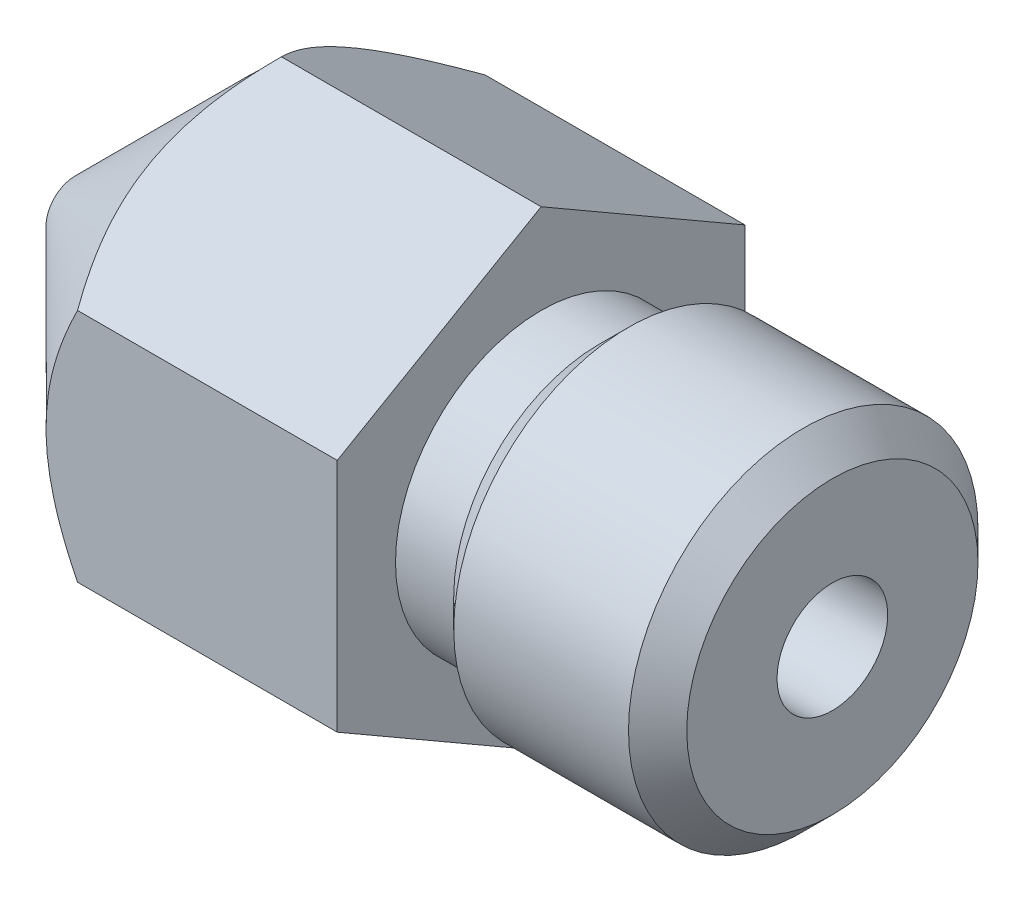
ISO-10303-21;
HEADER;
FILE_DESCRIPTION(('STEP AP214'),'2;1');
FILE_NAME('part.step','',(''),(''),'','','');
FILE_SCHEMA(('AUTOMOTIVE_DESIGN { 1 0 10303 214 1 1 1 1 }'));
ENDSEC;
DATA;
#1=APPLICATION_CONTEXT('core data for automotive mechanical design processes');
#2=APPLICATION_PROTOCOL_DEFINITION('international standard','automotive_design',2000,#1);
#3=PRODUCT_CONTEXT('',#1,'mechanical');
#4=PRODUCT('Part','Part','',(#3));
#5=PRODUCT_RELATED_PRODUCT_CATEGORY('part','',(#4));
#6=PRODUCT_DEFINITION_FORMATION('','',#4);
#7=PRODUCT_DEFINITION_CONTEXT('part definition',#1,'design');
#8=PRODUCT_DEFINITION('design','',#6,#7);
#9=PRODUCT_DEFINITION_SHAPE('','',#8);
#10=(LENGTH_UNIT() NAMED_UNIT(*) SI_UNIT(.MILLI.,.METRE.));
#11=(NAMED_UNIT(*) PLANE_ANGLE_UNIT() SI_UNIT($,.RADIAN.));
#12=(NAMED_UNIT(*) SI_UNIT($,.STERADIAN.) SOLID_ANGLE_UNIT());
#13=UNCERTAINTY_MEASURE_WITH_UNIT(LENGTH_MEASURE(1.E-05),#10,'distance_accuracy_value','');
#14=(GEOMETRIC_REPRESENTATION_CONTEXT(3) GLOBAL_UNCERTAINTY_ASSIGNED_CONTEXT((#13)) GLOBAL_UNIT_ASSIGNED_CONTEXT((#10,
#11,#12)) REPRESENTATION_CONTEXT('',''));
#15=CARTESIAN_POINT('',(0.,0.,0.));
#16=DIRECTION('',(0.,0.,1.));
#17=DIRECTION('',(1.,0.,0.));
#18=AXIS2_PLACEMENT_3D('',#15,#16,#17);
#19=CARTESIAN_POINT('',(8.,2.5,0.));
#20=DIRECTION('',(-1.,0.,0.));
#21=DIRECTION('',(0.,0.,1.));
#22=AXIS2_PLACEMENT_3D('',#19,#20,#21);
#23=PLANE('',#22);
#24=CARTESIAN_POINT('',(8.,0.,0.));
#25=DIRECTION('',(-1.,0.,0.));
#26=DIRECTION('',(0.,0.,1.));
#27=AXIS2_PLACEMENT_3D('',#24,#25,#26);
#28=CIRCLE('',#27,2.5);
#29=CARTESIAN_POINT('',(8.,0.,2.5));
#30=VERTEX_POINT('',#29);
#31=EDGE_CURVE('E133',#30,#30,#28,.T.);
#32=ORIENTED_EDGE('',*,*,#31,.T.);
#33=EDGE_LOOP('',(#32));
#34=FACE_BOUND('',#33,.T.);
#35=DIRECTION('',(0.,-1.,0.));
#36=VECTOR('',#35,1.);
#37=CARTESIAN_POINT('',(8.,2.02072594216369,3.5));
#38=LINE('',#37,#36);
#39=CARTESIAN_POINT('',(8.,2.02072594216369,3.5));
#40=VERTEX_POINT('',#39);
#41=CARTESIAN_POINT('',(8.,-2.02072594216369,3.5));
#42=VERTEX_POINT('',#41);
#43=EDGE_CURVE('E112',#40,#42,#38,.T.);
#44=ORIENTED_EDGE('',*,*,#43,.T.);
#45=DIRECTION('',(0.,-0.5,-0.866025403784439));
#46=VECTOR('',#45,1.);
#47=CARTESIAN_POINT('',(8.,-2.02072594216369,3.5));
#48=LINE('',#47,#46);
#49=CARTESIAN_POINT('',(8.,-4.04145188432738,0.));
#50=VERTEX_POINT('',#49);
#51=EDGE_CURVE('E110',#42,#50,#48,.T.);
#52=ORIENTED_EDGE('',*,*,#51,.T.);
#53=DIRECTION('',(0.,0.5,-0.866025403784439));
#54=VECTOR('',#53,1.);
#55=CARTESIAN_POINT('',(8.,-4.04145188432738,0.));
#56=LINE('',#55,#54);
#57=CARTESIAN_POINT('',(8.,-2.02072594216369,-3.5));
#58=VERTEX_POINT('',#57);
#59=EDGE_CURVE('E52',#50,#58,#56,.T.);
#60=ORIENTED_EDGE('',*,*,#59,.T.);
#61=DIRECTION('',(0.,1.,0.));
#62=VECTOR('',#61,1.);
#63=CARTESIAN_POINT('',(8.,-2.02072594216369,-3.5));
#64=LINE('',#63,#62);
#65=CARTESIAN_POINT('',(8.,2.02072594216369,-3.5));
#66=VERTEX_POINT('',#65);
#67=EDGE_CURVE('E100',#58,#66,#64,.T.);
#68=ORIENTED_EDGE('',*,*,#67,.T.);
#69=DIRECTION('',(0.,0.5,0.866025403784439));
#70=VECTOR('',#69,1.);
#71=CARTESIAN_POINT('',(8.,2.02072594216369,-3.5));
#72=LINE('',#71,#70);
#73=CARTESIAN_POINT('',(8.,4.04145188432738,0.));
#74=VERTEX_POINT('',#73);
#75=EDGE_CURVE('E106',#66,#74,#72,.T.);
#76=ORIENTED_EDGE('',*,*,#75,.T.);
#77=DIRECTION('',(0.,-0.5,0.866025403784439));
#78=VECTOR('',#77,1.);
#79=CARTESIAN_POINT('',(8.,4.04145188432738,0.));
#80=LINE('',#79,#78);
#81=EDGE_CURVE('E117',#74,#40,#80,.T.);
#82=ORIENTED_EDGE('',*,*,#81,.T.);
#83=EDGE_LOOP('',(#44,#52,#60,#68,#76,#82));
#84=FACE_BOUND('',#83,.T.);
#85=ADVANCED_FACE('F37',(#34,#84),#23,.F.);
#86=CARTESIAN_POINT('',(4.,0.,0.));
#87=DIRECTION('',(1.,0.,0.));
#88=DIRECTION('',(0.,0.,-1.));
#89=AXIS2_PLACEMENT_3D('',#86,#87,#88);
#90=CONICAL_SURFACE('',#89,4.5,0.78539816339745);
#91=CARTESIAN_POINT('',(0.,0.,0.));
#92=DIRECTION('',(-1.,0.,0.));
#93=DIRECTION('',(0.,0.,1.));
#94=AXIS2_PLACEMENT_3D('',#91,#92,#93);
#95=CIRCLE('',#94,0.499999999999984);
#96=CARTESIAN_POINT('',(0.,0.,0.499999999999984));
#97=VERTEX_POINT('',#96);
#98=EDGE_CURVE('E130',#97,#97,#95,.T.);
#99=ORIENTED_EDGE('',*,*,#98,.F.);
#100=EDGE_LOOP('',(#99));
#101=FACE_BOUND('',#100,.T.);
#102=CARTESIAN_POINT('',(5.60473460571073,-5.00177814443646,3.5));
#103=CARTESIAN_POINT('',(5.50158525305018,-4.87585100221837,3.5));
#104=CARTESIAN_POINT('',(5.39916732462682,-4.74931512243237,3.5));
#105=CARTESIAN_POINT('',(5.19618183428807,-4.49471658352455,3.5));
#106=CARTESIAN_POINT('',(5.09561475080956,-4.36665354335295,3.5));
#107=CARTESIAN_POINT('',(4.8956806099685,-4.1073404488107,3.5));
#108=CARTESIAN_POINT('',(4.79633882689846,-3.97607084326665,3.5));
#109=CARTESIAN_POINT('',(4.60061166670264,-3.71135912834578,3.5));
#110=CARTESIAN_POINT('',(4.50422600560764,-3.57791722953954,3.5));
#111=CARTESIAN_POINT('',(4.30644876507746,-3.29590423287125,3.5));
#112=CARTESIAN_POINT('',(4.20542063931455,-3.14707678989524,3.5));
#113=CARTESIAN_POINT('',(4.0092782092562,-2.84547482694549,3.5));
#114=CARTESIAN_POINT('',(3.91416582545941,-2.69269904772549,3.5));
#115=CARTESIAN_POINT('',(3.73242858701602,-2.38308612845867,3.5));
#116=CARTESIAN_POINT('',(3.64576650922454,-2.22627104221582,3.5));
#117=CARTESIAN_POINT('',(3.48347840457084,-1.90708387824138,3.5));
#118=CARTESIAN_POINT('',(3.4078428797255,-1.74471673355065,3.5));
#119=CARTESIAN_POINT('',(3.29115360790501,-1.46096984620552,3.5));
#120=CARTESIAN_POINT('',(3.24639235010286,-1.34112588832474,3.5));
#121=CARTESIAN_POINT('',(3.16645824704642,-1.09820885957048,3.5));
#122=CARTESIAN_POINT('',(3.13128671673046,-0.975135348396179,3.5));
#123=CARTESIAN_POINT('',(3.07315329237583,-0.728966718302567,3.5));
#124=CARTESIAN_POINT('',(3.04993834404319,-0.605932392197103,3.5));
#125=CARTESIAN_POINT('',(3.01613662323999,-0.358129563749721,3.5));
#126=CARTESIAN_POINT('',(3.00554687121748,-0.233361477610497,3.5));
#127=CARTESIAN_POINT('',(2.9980076393283,0.0101654253989616,3.5));
#128=CARTESIAN_POINT('',(3.0003849263801,0.128903431666411,3.5));
#129=CARTESIAN_POINT('',(3.01705527222058,0.365532552222858,3.5));
#130=CARTESIAN_POINT('',(3.03134918273084,0.483423605369748,3.5));
#131=CARTESIAN_POINT('',(3.07126805871322,0.719563148573866,3.5));
#132=CARTESIAN_POINT('',(3.09710502038985,0.83777515440585,3.5));
#133=CARTESIAN_POINT('',(3.15862164673052,1.07156228973921,3.5));
#134=CARTESIAN_POINT('',(3.19430109896366,1.1871374760929,3.5));
#135=CARTESIAN_POINT('',(3.27495249430218,1.41857905527411,3.5));
#136=CARTESIAN_POINT('',(3.32015561728366,1.53436386685402,3.5));
#137=CARTESIAN_POINT('',(3.41756542323519,1.7629573042304,3.5));
#138=CARTESIAN_POINT('',(3.46977427633029,1.87576499481178,3.5));
#139=CARTESIAN_POINT('',(3.57996695790531,2.09894682323399,3.5));
#140=CARTESIAN_POINT('',(3.63796861954407,2.20931208353451,3.5));
#141=CARTESIAN_POINT('',(3.75847190730103,2.42752018879847,3.5));
#142=CARTESIAN_POINT('',(3.82097285702742,2.53536340969175,3.5));
#143=CARTESIAN_POINT('',(3.94642001487544,2.74357548029041,3.5));
#144=CARTESIAN_POINT('',(4.00919138032335,2.8440502327273,3.5));
#145=CARTESIAN_POINT('',(4.13742428325754,3.04327327614903,3.5));
#146=CARTESIAN_POINT('',(4.20288602031573,3.14202143827798,3.5));
#147=CARTESIAN_POINT('',(4.33549374104825,3.33722918559784,3.5));
#148=CARTESIAN_POINT('',(4.40262218906713,3.43370072609763,3.5));
#149=CARTESIAN_POINT('',(4.53869269345195,3.62531773450166,3.5));
#150=CARTESIAN_POINT('',(4.60763424496689,3.72046356049015,3.5));
#151=CARTESIAN_POINT('',(4.67731849112517,3.81505265475415,3.5));
#152=B_SPLINE_CURVE_WITH_KNOTS('',3,(#102,#103,#104,#105,#106,#107,#108,#109,#110,#111,#112,
#113,#114,#115,#116,#117,#118,#119,#120,#121,#122,#123,#124,#125,#126,#127,#128,#129,#130,#131,
#132,#133,#134,#135,#136,#137,#138,#139,#140,#141,#142,#143,#144,#145,#146,#147,#148,#149,#150,
#151),.UNSPECIFIED.,.F.,.F.,(4,2,2,2,2,2,2,2,2,2,2,2,2,2,2,2,2,2,2,2,2,2,2,2,4),(0.,
0.488349249027166,0.976823010095185,1.47065642848088,1.96444225899961,2.50397255703355,
3.04367710477862,3.58088531780657,4.11762802448125,4.50109851017833,4.88462155073114,
5.25965435197999,5.63459862778907,5.99026775687149,6.34596230901475,6.70847660551895,
7.07098307847279,7.44358822460948,7.81630905811278,8.19021491747463,8.56406468333309,
8.91942809068196,9.27481790665746,9.62738125871665,9.97984745921805),.UNSPECIFIED.);
#153=CARTESIAN_POINT('',(3.54145188432738,2.02072594216369,3.5));
#154=VERTEX_POINT('',#153);
#155=CARTESIAN_POINT('',(3.54145188432738,-2.02072594216369,3.5));
#156=VERTEX_POINT('',#155);
#157=EDGE_CURVE('E180',#154,#156,#152,.F.);
#158=ORIENTED_EDGE('',*,*,#157,.F.);
#159=CARTESIAN_POINT('',(3.5415673593298,4.04156735438122,-0.000199999999999954));
#160=CARTESIAN_POINT('',(3.47216781805871,3.9721070606697,0.120108757817009));
#161=CARTESIAN_POINT('',(3.40684436318291,3.90148531215405,0.24242921436546));
#162=CARTESIAN_POINT('',(3.28723893601392,3.75747991147153,0.491853884911907));
#163=CARTESIAN_POINT('',(3.23302350720678,3.68408256574985,0.618981816842553));
#164=CARTESIAN_POINT('',(3.14015155956122,3.53608035685404,0.875329162282526));
#165=CARTESIAN_POINT('',(3.1012616245349,3.46151318117029,1.00448329914368));
#166=CARTESIAN_POINT('',(3.04134378872047,3.310737295381,1.26563479388695));
#167=CARTESIAN_POINT('',(3.02027116467501,3.2345331906662,1.39762417499828));
#168=CARTESIAN_POINT('',(3.00125799897574,3.10319782183117,1.62510370665135));
#169=CARTESIAN_POINT('',(2.99844358418733,3.04823615399913,1.72030010780516));
#170=CARTESIAN_POINT('',(3.00318657176733,2.93840222621347,1.91053805112478));
#171=CARTESIAN_POINT('',(3.0107476100844,2.88353000435281,2.00557952731163));
#172=CARTESIAN_POINT('',(3.03580978058179,2.77430542200351,2.1947620533761));
#173=CARTESIAN_POINT('',(3.0533220307075,2.71995371223668,2.2889019761705));
#174=CARTESIAN_POINT('',(3.09733078172171,2.61218376551827,2.47556499941577));
#175=CARTESIAN_POINT('',(3.12382659379173,2.55876545732784,2.56808822325597));
#176=CARTESIAN_POINT('',(3.17833985376172,2.46393368006795,2.73234167964216));
#177=CARTESIAN_POINT('',(3.20492418817716,2.42231028209655,2.80443551971228));
#178=CARTESIAN_POINT('',(3.26237725929072,2.33981072759411,2.9473289397123));
#179=CARTESIAN_POINT('',(3.29324612649086,2.29893459386684,3.01812848014492));
#180=CARTESIAN_POINT('',(3.35857622497152,2.21805834837751,3.15821024645785));
#181=CARTESIAN_POINT('',(3.39302615997836,2.17805593632086,3.22749645656528));
#182=CARTESIAN_POINT('',(3.46506598404272,2.09879193666161,3.36478573118621));
#183=CARTESIAN_POINT('',(3.50265394638793,2.05952991236255,3.43278955208019));
#184=CARTESIAN_POINT('',(3.5415673593298,2.02061047210985,3.5002));
#185=B_SPLINE_CURVE_WITH_KNOTS('',3,(#159,#160,#161,#162,#163,#164,#165,#166,#167,#168,#169,
#170,#171,#172,#173,#174,#175,#176,#177,#178,#179,#180,#181,#182,#183,#184),.UNSPECIFIED.,.F.,
.F.,(4,2,2,2,2,2,2,2,2,2,2,2,4),(0.,0.466195029511835,0.935106055247667,1.3965703522971,
1.85687285909025,2.18628459516077,2.51581179896772,2.845707891424,3.17557869467338,
3.43762138891189,3.69967206642681,3.96091985737577,4.22200840855896),.UNSPECIFIED.);
#186=CARTESIAN_POINT('',(3.54145188432739,4.04145188432738,0.));
#187=VERTEX_POINT('',#186);
#188=EDGE_CURVE('E188',#187,#154,#185,.T.);
#189=ORIENTED_EDGE('',*,*,#188,.F.);
#190=CARTESIAN_POINT('',(3.5415673593298,2.02061047210985,-3.5002));
#191=CARTESIAN_POINT('',(3.47216781805871,2.09007076582137,-3.37989124218299));
#192=CARTESIAN_POINT('',(3.40684436318291,2.16069251433702,-3.25757078563454));
#193=CARTESIAN_POINT('',(3.28723893601392,2.30469791501955,-3.0081461150881));
#194=CARTESIAN_POINT('',(3.23302350720678,2.37809526074122,-2.88101818315745));
#195=CARTESIAN_POINT('',(3.14015155956122,2.52609746963704,-2.62467083771748));
#196=CARTESIAN_POINT('',(3.1012616245349,2.60066464532078,-2.49551670085632));
#197=CARTESIAN_POINT('',(3.04134378872047,2.75144053111008,-2.23436520611305));
#198=CARTESIAN_POINT('',(3.02027116467501,2.82764463582488,-2.10237582500172));
#199=CARTESIAN_POINT('',(3.00125799897574,2.9589800046599,-1.87489629334866));
#200=CARTESIAN_POINT('',(2.99844358418733,3.01394167249194,-1.77969989219485));
#201=CARTESIAN_POINT('',(3.00318657176733,3.12377560027761,-1.58946194887522));
#202=CARTESIAN_POINT('',(3.0107476100844,3.17864782213826,-1.49442047268838));
#203=CARTESIAN_POINT('',(3.03580978058179,3.28787240448756,-1.3052379466239));
#204=CARTESIAN_POINT('',(3.0533220307075,3.34222411425439,-1.2110980238295));
#205=CARTESIAN_POINT('',(3.09733078172171,3.4499940609728,-1.02443500058423));
#206=CARTESIAN_POINT('',(3.12382659379173,3.50341236916323,-0.931911776744036));
#207=CARTESIAN_POINT('',(3.17833985376172,3.59824414642313,-0.767658320357845));
#208=CARTESIAN_POINT('',(3.20492418817716,3.63986754439453,-0.69556448028772));
#209=CARTESIAN_POINT('',(3.26237725929072,3.72236709889696,-0.552671060287704));
#210=CARTESIAN_POINT('',(3.29324612649086,3.76324323262424,-0.481871519855082));
#211=CARTESIAN_POINT('',(3.35857622497152,3.84411947811356,-0.341789753542154));
#212=CARTESIAN_POINT('',(3.39302615997836,3.88412189017022,-0.272503543434724));
#213=CARTESIAN_POINT('',(3.46506598404272,3.96338588982946,-0.135214268813787));
#214=CARTESIAN_POINT('',(3.50265394638793,4.00264791412852,-0.0672104479198107));
#215=CARTESIAN_POINT('',(3.5415673593298,4.04156735438122,0.00020000000000017));
#216=B_SPLINE_CURVE_WITH_KNOTS('',3,(#190,#191,#192,#193,#194,#195,#196,#197,#198,#199,#200,
#201,#202,#203,#204,#205,#206,#207,#208,#209,#210,#211,#212,#213,#214,#215),.UNSPECIFIED.,.F.,
.F.,(4,2,2,2,2,2,2,2,2,2,2,2,4),(0.,0.466195029511835,0.935106055247667,1.3965703522971,
1.85687285909025,2.18628459516076,2.51581179896771,2.845707891424,3.17557869467337,
3.43762138891189,3.69967206642681,3.96091985737577,4.22200840855896),.UNSPECIFIED.);
#217=CARTESIAN_POINT('',(3.54145188432739,2.02072594216369,-3.5));
#218=VERTEX_POINT('',#217);
#219=EDGE_CURVE('E256',#218,#187,#216,.T.);
#220=ORIENTED_EDGE('',*,*,#219,.F.);
#221=CARTESIAN_POINT('',(5.60473460571074,-5.00177814443646,-3.5));
#222=CARTESIAN_POINT('',(5.50158525305018,-4.87585100221837,-3.5));
#223=CARTESIAN_POINT('',(5.39916732462683,-4.74931512243238,-3.5));
#224=CARTESIAN_POINT('',(5.19618183428808,-4.49471658352455,-3.5));
#225=CARTESIAN_POINT('',(5.09561475080957,-4.36665354335295,-3.5));
#226=CARTESIAN_POINT('',(4.8956806099685,-4.1073404488107,-3.5));
#227=CARTESIAN_POINT('',(4.79633882689846,-3.97607084326666,-3.5));
#228=CARTESIAN_POINT('',(4.60061166670265,-3.71135912834578,-3.5));
#229=CARTESIAN_POINT('',(4.50422600560765,-3.57791722953954,-3.5));
#230=CARTESIAN_POINT('',(4.30644876507746,-3.29590423287125,-3.5));
#231=CARTESIAN_POINT('',(4.20542063931455,-3.14707678989524,-3.5));
#232=CARTESIAN_POINT('',(4.00927820925621,-2.84547482694549,-3.5));
#233=CARTESIAN_POINT('',(3.91416582545942,-2.69269904772549,-3.5));
#234=CARTESIAN_POINT('',(3.73242858701603,-2.38308612845867,-3.5));
#235=CARTESIAN_POINT('',(3.64576650922454,-2.22627104221582,-3.5));
#236=CARTESIAN_POINT('',(3.48347840457084,-1.90708387824137,-3.5));
#237=CARTESIAN_POINT('',(3.4078428797255,-1.74471673355065,-3.5));
#238=CARTESIAN_POINT('',(3.29115360790502,-1.46096984620551,-3.5));
#239=CARTESIAN_POINT('',(3.24639235010286,-1.34112588832474,-3.5));
#240=CARTESIAN_POINT('',(3.16645824704642,-1.09820885957048,-3.5));
#241=CARTESIAN_POINT('',(3.13128671673046,-0.975135348396178,-3.5));
#242=CARTESIAN_POINT('',(3.07315329237583,-0.728966718302567,-3.5));
#243=CARTESIAN_POINT('',(3.04993834404319,-0.605932392197102,-3.5));
#244=CARTESIAN_POINT('',(3.01613662324,-0.358129563749721,-3.5));
#245=CARTESIAN_POINT('',(3.00554687121749,-0.233361477610496,-3.5));
#246=CARTESIAN_POINT('',(2.9980076393283,0.0101654253989624,-3.5));
#247=CARTESIAN_POINT('',(3.0003849263801,0.128903431666412,-3.5));
#248=CARTESIAN_POINT('',(3.01705527222059,0.365532552222859,-3.5));
#249=CARTESIAN_POINT('',(3.03134918273085,0.48342360536975,-3.5));
#250=CARTESIAN_POINT('',(3.07126805871322,0.719563148573868,-3.5));
#251=CARTESIAN_POINT('',(3.09710502038985,0.837775154405851,-3.5));
#252=CARTESIAN_POINT('',(3.15862164673053,1.07156228973921,-3.5));
#253=CARTESIAN_POINT('',(3.19430109896366,1.1871374760929,-3.5));
#254=CARTESIAN_POINT('',(3.27495249430218,1.41857905527411,-3.5));
#255=CARTESIAN_POINT('',(3.32015561728366,1.53436386685402,-3.5));
#256=CARTESIAN_POINT('',(3.41756542323519,1.76295730423041,-3.5));
#257=CARTESIAN_POINT('',(3.4697742763303,1.87576499481178,-3.5));
#258=CARTESIAN_POINT('',(3.57996695790532,2.09894682323399,-3.5));
#259=CARTESIAN_POINT('',(3.63796861954407,2.20931208353452,-3.5));
#260=CARTESIAN_POINT('',(3.75847190730104,2.42752018879848,-3.5));
#261=CARTESIAN_POINT('',(3.82097285702742,2.53536340969176,-3.5));
#262=CARTESIAN_POINT('',(3.94642001487544,2.74357548029041,-3.5));
#263=CARTESIAN_POINT('',(4.00919138032335,2.84405023272731,-3.5));
#264=CARTESIAN_POINT('',(4.13742428325754,3.04327327614903,-3.5));
#265=CARTESIAN_POINT('',(4.20288602031574,3.14202143827798,-3.5));
#266=CARTESIAN_POINT('',(4.33549374104825,3.33722918559784,-3.5));
#267=CARTESIAN_POINT('',(4.40262218906713,3.43370072609764,-3.5));
#268=CARTESIAN_POINT('',(4.53869269345195,3.62531773450166,-3.5));
#269=CARTESIAN_POINT('',(4.6076342449669,3.72046356049016,-3.5));
#270=CARTESIAN_POINT('',(4.67731849112518,3.81505265475415,-3.5));
#271=B_SPLINE_CURVE_WITH_KNOTS('',3,(#221,#222,#223,#224,#225,#226,#227,#228,#229,#230,#231,
#232,#233,#234,#235,#236,#237,#238,#239,#240,#241,#242,#243,#244,#245,#246,#247,#248,#249,#250,
#251,#252,#253,#254,#255,#256,#257,#258,#259,#260,#261,#262,#263,#264,#265,#266,#267,#268,#269,
#270),.UNSPECIFIED.,.F.,.F.,(4,2,2,2,2,2,2,2,2,2,2,2,2,2,2,2,2,2,2,2,2,2,2,2,4),(0.,
0.488349249027167,0.976823010095186,1.47065642848089,1.96444225899962,2.50397255703356,
3.04367710477862,3.58088531780658,4.11762802448125,4.50109851017834,4.88462155073114,
5.25965435197999,5.63459862778907,5.99026775687149,6.34596230901476,6.70847660551895,
7.0709830784728,7.44358822460949,7.81630905811279,8.19021491747464,8.56406468333311,
8.91942809068197,9.27481790665748,9.62738125871667,9.97984745921806),.UNSPECIFIED.);
#272=CARTESIAN_POINT('',(3.54145188432739,-2.02072594216369,-3.5));
#273=VERTEX_POINT('',#272);
#274=EDGE_CURVE('E257',#273,#218,#271,.T.);
#275=ORIENTED_EDGE('',*,*,#274,.F.);
#276=CARTESIAN_POINT('',(3.5415673593298,-4.04156735438122,0.000199999999996348));
#277=CARTESIAN_POINT('',(3.47216781805871,-3.9721070606697,-0.120108757817013));
#278=CARTESIAN_POINT('',(3.40684436318291,-3.90148531215405,-0.242429214365463));
#279=CARTESIAN_POINT('',(3.28723893601391,-3.75747991147153,-0.491853884911911));
#280=CARTESIAN_POINT('',(3.23302350720678,-3.68408256574985,-0.618981816842557));
#281=CARTESIAN_POINT('',(3.14015155956122,-3.53608035685404,-0.87532916228253));
#282=CARTESIAN_POINT('',(3.10126162453491,-3.46151318117029,-1.00448329914369));
#283=CARTESIAN_POINT('',(3.04134378872047,-3.310737295381,-1.26563479388695));
#284=CARTESIAN_POINT('',(3.02027116467501,-3.2345331906662,-1.39762417499828));
#285=CARTESIAN_POINT('',(3.00125799897574,-3.10319782183117,-1.62510370665135));
#286=CARTESIAN_POINT('',(2.99844358418733,-3.04823615399913,-1.72030010780516));
#287=CARTESIAN_POINT('',(3.00318657176733,-2.93840222621347,-1.91053805112479));
#288=CARTESIAN_POINT('',(3.0107476100844,-2.88353000435281,-2.00557952731163));
#289=CARTESIAN_POINT('',(3.03580978058179,-2.77430542200351,-2.1947620533761));
#290=CARTESIAN_POINT('',(3.0533220307075,-2.71995371223668,-2.2889019761705));
#291=CARTESIAN_POINT('',(3.09733078172171,-2.61218376551827,-2.47556499941577));
#292=CARTESIAN_POINT('',(3.12382659379174,-2.55876545732784,-2.56808822325597));
#293=CARTESIAN_POINT('',(3.17833985376172,-2.46393368006795,-2.73234167964216));
#294=CARTESIAN_POINT('',(3.20492418817716,-2.42231028209655,-2.80443551971228));
#295=CARTESIAN_POINT('',(3.26237725929072,-2.33981072759411,-2.9473289397123));
#296=CARTESIAN_POINT('',(3.29324612649086,-2.29893459386684,-3.01812848014492));
#297=CARTESIAN_POINT('',(3.35857622497152,-2.21805834837751,-3.15821024645785));
#298=CARTESIAN_POINT('',(3.39302615997836,-2.17805593632086,-3.22749645656528));
#299=CARTESIAN_POINT('',(3.46506598404272,-2.09879193666161,-3.36478573118622));
#300=CARTESIAN_POINT('',(3.50265394638794,-2.05952991236255,-3.43278955208019));
#301=CARTESIAN_POINT('',(3.5415673593298,-2.02061047210985,-3.5002));
#302=B_SPLINE_CURVE_WITH_KNOTS('',3,(#276,#277,#278,#279,#280,#281,#282,#283,#284,#285,#286,
#287,#288,#289,#290,#291,#292,#293,#294,#295,#296,#297,#298,#299,#300,#301),.UNSPECIFIED.,.F.,
.F.,(4,2,2,2,2,2,2,2,2,2,2,2,4),(0.,0.466195029511834,0.935106055247666,1.3965703522971,
1.85687285909025,2.18628459516076,2.51581179896771,2.845707891424,3.17557869467337,
3.43762138891189,3.69967206642681,3.96091985737577,4.22200840855895),.UNSPECIFIED.);
#303=CARTESIAN_POINT('',(3.54145188432738,-4.04145188432738,0.));
#304=VERTEX_POINT('',#303);
#305=EDGE_CURVE('E93',#304,#273,#302,.T.);
#306=ORIENTED_EDGE('',*,*,#305,.F.);
#307=CARTESIAN_POINT('',(3.5415673593298,-2.02061047210985,3.5002));
#308=CARTESIAN_POINT('',(3.47216781805871,-2.09007076582137,3.37989124218299));
#309=CARTESIAN_POINT('',(3.40684436318291,-2.16069251433702,3.25757078563454));
#310=CARTESIAN_POINT('',(3.28723893601391,-2.30469791501954,3.00814611508809));
#311=CARTESIAN_POINT('',(3.23302350720678,-2.37809526074122,2.88101818315745));
#312=CARTESIAN_POINT('',(3.14015155956122,-2.52609746963704,2.62467083771747));
#313=CARTESIAN_POINT('',(3.1012616245349,-2.60066464532078,2.49551670085632));
#314=CARTESIAN_POINT('',(3.04134378872046,-2.75144053111008,2.23436520611305));
#315=CARTESIAN_POINT('',(3.02027116467501,-2.82764463582488,2.10237582500172));
#316=CARTESIAN_POINT('',(3.00125799897574,-2.9589800046599,1.87489629334865));
#317=CARTESIAN_POINT('',(2.99844358418733,-3.01394167249194,1.77969989219484));
#318=CARTESIAN_POINT('',(3.00318657176733,-3.12377560027761,1.58946194887522));
#319=CARTESIAN_POINT('',(3.0107476100844,-3.17864782213826,1.49442047268837));
#320=CARTESIAN_POINT('',(3.03580978058179,-3.28787240448756,1.3052379466239));
#321=CARTESIAN_POINT('',(3.05332203070749,-3.34222411425439,1.2110980238295));
#322=CARTESIAN_POINT('',(3.09733078172171,-3.4499940609728,1.02443500058423));
#323=CARTESIAN_POINT('',(3.12382659379173,-3.50341236916323,0.931911776744033));
#324=CARTESIAN_POINT('',(3.17833985376171,-3.59824414642312,0.767658320357841));
#325=CARTESIAN_POINT('',(3.20492418817716,-3.63986754439452,0.695564480287717));
#326=CARTESIAN_POINT('',(3.26237725929072,-3.72236709889696,0.552671060287701));
#327=CARTESIAN_POINT('',(3.29324612649085,-3.76324323262424,0.481871519855078));
#328=CARTESIAN_POINT('',(3.35857622497152,-3.84411947811356,0.341789753542151));
#329=CARTESIAN_POINT('',(3.39302615997836,-3.88412189017022,0.27250354343472));
#330=CARTESIAN_POINT('',(3.46506598404272,-3.96338588982946,0.135214268813784));
#331=CARTESIAN_POINT('',(3.50265394638793,-4.00264791412852,0.0672104479198071));
#332=CARTESIAN_POINT('',(3.5415673593298,-4.04156735438122,-0.000200000000003697));
#333=B_SPLINE_CURVE_WITH_KNOTS('',3,(#307,#308,#309,#310,#311,#312,#313,#314,#315,#316,#317,
#318,#319,#320,#321,#322,#323,#324,#325,#326,#327,#328,#329,#330,#331,#332),.UNSPECIFIED.,.F.,
.F.,(4,2,2,2,2,2,2,2,2,2,2,2,4),(0.,0.466195029511835,0.935106055247667,1.3965703522971,
1.85687285909025,2.18628459516077,2.51581179896772,2.845707891424,3.17557869467338,
3.43762138891189,3.69967206642681,3.96091985737577,4.22200840855896),.UNSPECIFIED.);
#334=EDGE_CURVE('E148',#156,#304,#333,.T.);
#335=ORIENTED_EDGE('',*,*,#334,.F.);
#336=EDGE_LOOP('',(#158,#189,#220,#275,#306,#335));
#337=FACE_BOUND('',#336,.T.);
#338=ADVANCED_FACE('F162',(#101,#337),#90,.T.);
#339=CARTESIAN_POINT('',(0.,0.,0.));
#340=DIRECTION('',(-1.,0.,0.));
#341=DIRECTION('',(0.,0.,1.));
#342=AXIS2_PLACEMENT_3D('',#339,#340,#341);
#343=CYLINDRICAL_SURFACE('',#342,0.2);
#344=CARTESIAN_POINT('',(1.25,0.,0.));
#345=DIRECTION('',(-1.,0.,0.));
#346=DIRECTION('',(0.,0.,1.));
#347=AXIS2_PLACEMENT_3D('',#344,#345,#346);
#348=CIRCLE('',#347,0.2);
#349=CARTESIAN_POINT('',(1.25,0.,-0.2));
#350=VERTEX_POINT('',#349);
#351=EDGE_CURVE('E145',#350,#350,#348,.T.);
#352=ORIENTED_EDGE('',*,*,#351,.F.);
#353=EDGE_LOOP('',(#352));
#354=FACE_BOUND('',#353,.T.);
#355=CARTESIAN_POINT('',(0.,0.,0.));
#356=DIRECTION('',(-1.,0.,0.));
#357=DIRECTION('',(0.,0.,1.));
#358=AXIS2_PLACEMENT_3D('',#355,#356,#357);
#359=CIRCLE('',#358,0.2);
#360=CARTESIAN_POINT('',(0.,0.,0.2));
#361=VERTEX_POINT('',#360);
#362=EDGE_CURVE('E122',#361,#361,#359,.T.);
#363=ORIENTED_EDGE('',*,*,#362,.T.);
#364=EDGE_LOOP('',(#363));
#365=FACE_BOUND('',#364,.T.);
#366=ADVANCED_FACE('F215',(#354,#365),#343,.F.);
#367=CARTESIAN_POINT('',(1.25,0.,0.));
#368=DIRECTION('',(1.,0.,0.));
#369=DIRECTION('',(0.,0.,-1.));
#370=AXIS2_PLACEMENT_3D('',#367,#368,#369);
#371=CONICAL_SURFACE('',#370,0.2,0.78539816339745);
#372=CARTESIAN_POINT('',(2.,0.,0.));
#373=DIRECTION('',(-1.,0.,0.));
#374=DIRECTION('',(0.,0.,1.));
#375=AXIS2_PLACEMENT_3D('',#372,#373,#374);
#376=CIRCLE('',#375,0.95);
#377=CARTESIAN_POINT('',(2.,0.,-0.95));
#378=VERTEX_POINT('',#377);
#379=EDGE_CURVE('E142',#378,#378,#376,.T.);
#380=CARTESIAN_POINT('',(2.,0.,-0.95));
#381=CARTESIAN_POINT('',(1.9921875,0.,-0.9421875));
#382=CARTESIAN_POINT('',(1.984375,0.,-0.934375));
#383=CARTESIAN_POINT('',(1.96875,0.,-0.91875));
#384=CARTESIAN_POINT('',(1.9609375,0.,-0.9109375));
#385=CARTESIAN_POINT('',(1.9453125,0.,-0.8953125));
#386=CARTESIAN_POINT('',(1.9375,0.,-0.8875));
#387=CARTESIAN_POINT('',(1.921875,0.,-0.871875));
#388=CARTESIAN_POINT('',(1.9140625,0.,-0.8640625));
#389=CARTESIAN_POINT('',(1.8984375,0.,-0.8484375));
#390=CARTESIAN_POINT('',(1.890625,0.,-0.840625));
#391=CARTESIAN_POINT('',(1.875,0.,-0.825));
#392=CARTESIAN_POINT('',(1.8671875,0.,-0.8171875));
#393=CARTESIAN_POINT('',(1.8515625,0.,-0.8015625));
#394=CARTESIAN_POINT('',(1.84375,0.,-0.79375));
#395=CARTESIAN_POINT('',(1.828125,0.,-0.778125));
#396=CARTESIAN_POINT('',(1.8203125,0.,-0.7703125));
#397=CARTESIAN_POINT('',(1.8046875,0.,-0.7546875));
#398=CARTESIAN_POINT('',(1.796875,0.,-0.746875));
#399=CARTESIAN_POINT('',(1.78125,0.,-0.73125));
#400=CARTESIAN_POINT('',(1.7734375,0.,-0.7234375));
#401=CARTESIAN_POINT('',(1.7578125,0.,-0.7078125));
#402=CARTESIAN_POINT('',(1.75,0.,-0.7));
#403=CARTESIAN_POINT('',(1.734375,0.,-0.684375));
#404=CARTESIAN_POINT('',(1.7265625,0.,-0.6765625));
#405=CARTESIAN_POINT('',(1.7109375,0.,-0.6609375));
#406=CARTESIAN_POINT('',(1.703125,0.,-0.653125));
#407=CARTESIAN_POINT('',(1.6875,0.,-0.6375));
#408=CARTESIAN_POINT('',(1.6796875,0.,-0.6296875));
#409=CARTESIAN_POINT('',(1.6640625,0.,-0.6140625));
#410=CARTESIAN_POINT('',(1.65625,0.,-0.60625));
#411=CARTESIAN_POINT('',(1.640625,0.,-0.590625));
#412=CARTESIAN_POINT('',(1.6328125,0.,-0.5828125));
#413=CARTESIAN_POINT('',(1.6171875,0.,-0.5671875));
#414=CARTESIAN_POINT('',(1.609375,0.,-0.559375));
#415=CARTESIAN_POINT('',(1.59375,0.,-0.54375));
#416=CARTESIAN_POINT('',(1.5859375,0.,-0.5359375));
#417=CARTESIAN_POINT('',(1.5703125,0.,-0.5203125));
#418=CARTESIAN_POINT('',(1.5625,0.,-0.5125));
#419=CARTESIAN_POINT('',(1.546875,0.,-0.496875));
#420=CARTESIAN_POINT('',(1.5390625,0.,-0.4890625));
#421=CARTESIAN_POINT('',(1.5234375,0.,-0.4734375));
#422=CARTESIAN_POINT('',(1.515625,0.,-0.465625));
#423=CARTESIAN_POINT('',(1.5,0.,-0.45));
#424=CARTESIAN_POINT('',(1.4921875,0.,-0.4421875));
#425=CARTESIAN_POINT('',(1.4765625,0.,-0.4265625));
#426=CARTESIAN_POINT('',(1.46875,0.,-0.41875));
#427=CARTESIAN_POINT('',(1.453125,0.,-0.403125));
#428=CARTESIAN_POINT('',(1.4453125,0.,-0.3953125));
#429=CARTESIAN_POINT('',(1.4296875,0.,-0.3796875));
#430=CARTESIAN_POINT('',(1.421875,0.,-0.371875));
#431=CARTESIAN_POINT('',(1.40625,0.,-0.35625));
#432=CARTESIAN_POINT('',(1.3984375,0.,-0.3484375));
#433=CARTESIAN_POINT('',(1.3828125,0.,-0.3328125));
#434=CARTESIAN_POINT('',(1.375,0.,-0.325));
#435=CARTESIAN_POINT('',(1.359375,0.,-0.309375));
#436=CARTESIAN_POINT('',(1.3515625,0.,-0.3015625));
#437=CARTESIAN_POINT('',(1.3359375,0.,-0.2859375));
#438=CARTESIAN_POINT('',(1.328125,0.,-0.278125));
#439=CARTESIAN_POINT('',(1.3125,0.,-0.2625));
#440=CARTESIAN_POINT('',(1.3046875,0.,-0.2546875));
#441=CARTESIAN_POINT('',(1.2890625,0.,-0.2390625));
#442=CARTESIAN_POINT('',(1.28125,0.,-0.23125));
#443=CARTESIAN_POINT('',(1.265625,0.,-0.215625));
#444=CARTESIAN_POINT('',(1.2578125,0.,-0.2078125));
#445=CARTESIAN_POINT('',(1.25,0.,-0.2));
#446=B_SPLINE_CURVE_WITH_KNOTS('',3,(#380,#381,#382,#383,#384,#385,#386,#387,#388,#389,#390,
#391,#392,#393,#394,#395,#396,#397,#398,#399,#400,#401,#402,#403,#404,#405,#406,#407,#408,#409,
#410,#411,#412,#413,#414,#415,#416,#417,#418,#419,#420,#421,#422,#423,#424,#425,#426,#427,#428,
#429,#430,#431,#432,#433,#434,#435,#436,#437,#438,#439,#440,#441,#442,#443,#444,#445),
.UNSPECIFIED.,.F.,.F.,(4,2,2,2,2,2,2,2,2,2,2,2,2,2,2,2,2,2,2,2,2,2,2,2,2,2,2,2,2,2,2,2,4),(0.,
0.0331456303681191,0.0662912607362385,0.099436891104358,0.132582521472477,0.165728151840597,
0.198873782208716,0.232019412576835,0.265165042944955,0.298310673313074,0.331456303681194,
0.364601934049313,0.397747564417432,0.430893194785552,0.464038825153671,0.49718445552179,
0.53033008588991,0.563475716258029,0.596621346626149,0.629766976994268,0.662912607362387,
0.696058237730507,0.729203868098626,0.762349498466745,0.795495128834865,0.828640759202984,
0.861786389571103,0.894932019939223,0.928077650307342,0.961223280675462,0.994368911043581,
1.0275145414117,1.06066017177982),.UNSPECIFIED.);
#447=EDGE_CURVE('BSEAM231',#378,#350,#446,.T.);
#448=ORIENTED_EDGE('',*,*,#379,.F.);
#449=ORIENTED_EDGE('',*,*,#351,.T.);
#450=ORIENTED_EDGE('',*,*,#447,.T.);
#451=ORIENTED_EDGE('',*,*,#447,.F.);
#452=EDGE_LOOP('',(#448,#450,#449,#451));
#453=FACE_BOUND('',#452,.T.);
#454=ADVANCED_FACE('F231',(#453),#371,.F.);
#455=CARTESIAN_POINT('',(0.,0.,0.));
#456=DIRECTION('',(-1.,0.,0.));
#457=DIRECTION('',(0.,0.,1.));
#458=AXIS2_PLACEMENT_3D('',#455,#456,#457);
#459=CYLINDRICAL_SURFACE('',#458,0.95);
#460=CARTESIAN_POINT('',(13.,0.,0.));
#461=DIRECTION('',(-1.,0.,0.));
#462=DIRECTION('',(0.,0.,1.));
#463=AXIS2_PLACEMENT_3D('',#460,#461,#462);
#464=CIRCLE('',#463,0.95);
#465=CARTESIAN_POINT('',(13.,0.,0.95));
#466=VERTEX_POINT('',#465);
#467=EDGE_CURVE('E139',#466,#466,#464,.T.);
#468=ORIENTED_EDGE('',*,*,#467,.F.);
#469=EDGE_LOOP('',(#468));
#470=FACE_BOUND('',#469,.T.);
#471=ORIENTED_EDGE('',*,*,#379,.T.);
#472=EDGE_LOOP('',(#471));
#473=FACE_BOUND('',#472,.T.);
#474=ADVANCED_FACE('F227',(#470,#473),#459,.F.);
#475=CARTESIAN_POINT('',(13.,0.95,0.));
#476=DIRECTION('',(-1.,0.,0.));
#477=DIRECTION('',(0.,0.,1.));
#478=AXIS2_PLACEMENT_3D('',#475,#476,#477);
#479=PLANE('',#478);
#480=CARTESIAN_POINT('',(13.,0.,0.));
#481=DIRECTION('',(-1.,0.,0.));
#482=DIRECTION('',(0.,0.,1.));
#483=AXIS2_PLACEMENT_3D('',#480,#481,#482);
#484=CIRCLE('',#483,2.5);
#485=CARTESIAN_POINT('',(13.,0.,2.5));
#486=VERTEX_POINT('',#485);
#487=EDGE_CURVE('E12',#486,#486,#484,.F.);
#488=ORIENTED_EDGE('',*,*,#487,.T.);
#489=EDGE_LOOP('',(#488));
#490=FACE_BOUND('',#489,.T.);
#491=ORIENTED_EDGE('',*,*,#467,.T.);
#492=EDGE_LOOP('',(#491));
#493=FACE_BOUND('',#492,.T.);
#494=ADVANCED_FACE('F224',(#490,#493),#479,.F.);
#495=CARTESIAN_POINT('',(0.,0.,0.));
#496=DIRECTION('',(-1.,0.,0.));
#497=DIRECTION('',(0.,0.,1.));
#498=AXIS2_PLACEMENT_3D('',#495,#496,#497);
#499=CYLINDRICAL_SURFACE('',#498,3.);
#500=CARTESIAN_POINT('',(12.5,0.,0.));
#501=DIRECTION('',(-1.,0.,0.));
#502=DIRECTION('',(0.,0.,1.));
#503=AXIS2_PLACEMENT_3D('',#500,#501,#502);
#504=CIRCLE('',#503,3.);
#505=CARTESIAN_POINT('',(12.5,0.,3.));
#506=VERTEX_POINT('',#505);
#507=EDGE_CURVE('E45',#506,#506,#504,.T.);
#508=ORIENTED_EDGE('',*,*,#507,.T.);
#509=EDGE_LOOP('',(#508));
#510=FACE_BOUND('',#509,.T.);
#511=CARTESIAN_POINT('',(9.5,0.,0.));
#512=DIRECTION('',(1.,0.,0.));
#513=DIRECTION('',(0.,0.,-1.));
#514=AXIS2_PLACEMENT_3D('',#511,#512,#513);
#515=CIRCLE('',#514,3.);
#516=CARTESIAN_POINT('',(9.5,0.,-3.));
#517=VERTEX_POINT('',#516);
#518=EDGE_CURVE('E187',#517,#517,#515,.T.);
#519=ORIENTED_EDGE('',*,*,#518,.T.);
#520=EDGE_LOOP('',(#519));
#521=FACE_BOUND('',#520,.T.);
#522=ADVANCED_FACE('F199',(#510,#521),#499,.T.);
#523=CARTESIAN_POINT('',(0.,0.,0.));
#524=DIRECTION('',(-1.,0.,0.));
#525=DIRECTION('',(0.,0.,1.));
#526=AXIS2_PLACEMENT_3D('',#523,#524,#525);
#527=CYLINDRICAL_SURFACE('',#526,2.5);
#528=ORIENTED_EDGE('',*,*,#31,.F.);
#529=EDGE_LOOP('',(#528));
#530=FACE_BOUND('',#529,.T.);
#531=CARTESIAN_POINT('',(9.,0.,0.));
#532=DIRECTION('',(-1.,0.,0.));
#533=DIRECTION('',(0.,0.,1.));
#534=AXIS2_PLACEMENT_3D('',#531,#532,#533);
#535=CIRCLE('',#534,2.5);
#536=CARTESIAN_POINT('',(9.,0.,2.5));
#537=VERTEX_POINT('',#536);
#538=EDGE_CURVE('E136',#537,#537,#535,.T.);
#539=ORIENTED_EDGE('',*,*,#538,.T.);
#540=EDGE_LOOP('',(#539));
#541=FACE_BOUND('',#540,.T.);
#542=ADVANCED_FACE('F218',(#530,#541),#527,.T.);
#543=CARTESIAN_POINT('',(0.,0.499999999999984,0.));
#544=DIRECTION('',(1.,0.,0.));
#545=DIRECTION('',(0.,0.,-1.));
#546=AXIS2_PLACEMENT_3D('',#543,#544,#545);
#547=PLANE('',#546);
#548=ORIENTED_EDGE('',*,*,#362,.F.);
#549=EDGE_LOOP('',(#548));
#550=FACE_BOUND('',#549,.T.);
#551=ORIENTED_EDGE('',*,*,#98,.T.);
#552=EDGE_LOOP('',(#551));
#553=FACE_BOUND('',#552,.T.);
#554=ADVANCED_FACE('F177',(#550,#553),#547,.F.);
#555=CARTESIAN_POINT('',(-2.,2.02072594216369,3.5));
#556=DIRECTION('',(0.,0.,1.));
#557=DIRECTION('',(0.,-1.,0.));
#558=AXIS2_PLACEMENT_3D('',#555,#556,#557);
#559=PLANE('',#558);
#560=ORIENTED_EDGE('',*,*,#157,.T.);
#561=DIRECTION('',(1.,0.,0.));
#562=VECTOR('',#561,1.);
#563=CARTESIAN_POINT('',(-2.,-2.02072594216369,3.5));
#564=LINE('',#563,#562);
#565=EDGE_CURVE('E60',#156,#42,#564,.T.);
#566=ORIENTED_EDGE('',*,*,#565,.T.);
#567=ORIENTED_EDGE('',*,*,#43,.F.);
#568=DIRECTION('',(1.,0.,0.));
#569=VECTOR('',#568,1.);
#570=CARTESIAN_POINT('',(-2.,2.02072594216369,3.5));
#571=LINE('',#570,#569);
#572=EDGE_CURVE('E120',#154,#40,#571,.T.);
#573=ORIENTED_EDGE('',*,*,#572,.F.);
#574=EDGE_LOOP('',(#560,#566,#567,#573));
#575=FACE_BOUND('',#574,.T.);
#576=ADVANCED_FACE('F173',(#575),#559,.T.);
#577=CARTESIAN_POINT('',(-2.,4.04145188432738,0.));
#578=DIRECTION('',(0.,0.866025403784439,0.5));
#579=DIRECTION('',(0.,-0.5,0.866025403784439));
#580=AXIS2_PLACEMENT_3D('',#577,#578,#579);
#581=PLANE('',#580);
#582=ORIENTED_EDGE('',*,*,#188,.T.);
#583=ORIENTED_EDGE('',*,*,#572,.T.);
#584=ORIENTED_EDGE('',*,*,#81,.F.);
#585=DIRECTION('',(1.,0.,0.));
#586=VECTOR('',#585,1.);
#587=CARTESIAN_POINT('',(-2.,4.04145188432738,0.));
#588=LINE('',#587,#586);
#589=EDGE_CURVE('E123',#187,#74,#588,.T.);
#590=ORIENTED_EDGE('',*,*,#589,.F.);
#591=EDGE_LOOP('',(#582,#583,#584,#590));
#592=FACE_BOUND('',#591,.T.);
#593=ADVANCED_FACE('F176',(#592),#581,.T.);
#594=CARTESIAN_POINT('',(-2.,2.02072594216369,-3.5));
#595=DIRECTION('',(0.,0.866025403784439,-0.5));
#596=DIRECTION('',(0.,0.5,0.866025403784439));
#597=AXIS2_PLACEMENT_3D('',#594,#595,#596);
#598=PLANE('',#597);
#599=ORIENTED_EDGE('',*,*,#219,.T.);
#600=ORIENTED_EDGE('',*,*,#589,.T.);
#601=ORIENTED_EDGE('',*,*,#75,.F.);
#602=DIRECTION('',(1.,0.,0.));
#603=VECTOR('',#602,1.);
#604=CARTESIAN_POINT('',(-2.,2.02072594216369,-3.5));
#605=LINE('',#604,#603);
#606=EDGE_CURVE('E96',#218,#66,#605,.T.);
#607=ORIENTED_EDGE('',*,*,#606,.F.);
#608=EDGE_LOOP('',(#599,#600,#601,#607));
#609=FACE_BOUND('',#608,.T.);
#610=ADVANCED_FACE('F268',(#609),#598,.T.);
#611=CARTESIAN_POINT('',(-2.,-2.02072594216369,-3.5));
#612=DIRECTION('',(0.,0.,-1.));
#613=DIRECTION('',(0.,1.,0.));
#614=AXIS2_PLACEMENT_3D('',#611,#612,#613);
#615=PLANE('',#614);
#616=ORIENTED_EDGE('',*,*,#274,.T.);
#617=ORIENTED_EDGE('',*,*,#606,.T.);
#618=ORIENTED_EDGE('',*,*,#67,.F.);
#619=DIRECTION('',(1.,0.,0.));
#620=VECTOR('',#619,1.);
#621=CARTESIAN_POINT('',(-2.,-2.02072594216369,-3.5));
#622=LINE('',#621,#620);
#623=EDGE_CURVE('E89',#273,#58,#622,.T.);
#624=ORIENTED_EDGE('',*,*,#623,.F.);
#625=EDGE_LOOP('',(#616,#617,#618,#624));
#626=FACE_BOUND('',#625,.T.);
#627=ADVANCED_FACE('F101',(#626),#615,.T.);
#628=CARTESIAN_POINT('',(-2.,-4.04145188432738,0.));
#629=DIRECTION('',(0.,-0.866025403784439,-0.5));
#630=DIRECTION('',(0.,0.5,-0.866025403784439));
#631=AXIS2_PLACEMENT_3D('',#628,#629,#630);
#632=PLANE('',#631);
#633=ORIENTED_EDGE('',*,*,#305,.T.);
#634=ORIENTED_EDGE('',*,*,#623,.T.);
#635=ORIENTED_EDGE('',*,*,#59,.F.);
#636=DIRECTION('',(1.,0.,0.));
#637=VECTOR('',#636,1.);
#638=CARTESIAN_POINT('',(-2.,-4.04145188432738,0.));
#639=LINE('',#638,#637);
#640=EDGE_CURVE('E97',#304,#50,#639,.T.);
#641=ORIENTED_EDGE('',*,*,#640,.F.);
#642=EDGE_LOOP('',(#633,#634,#635,#641));
#643=FACE_BOUND('',#642,.T.);
#644=ADVANCED_FACE('F91',(#643),#632,.T.);
#645=CARTESIAN_POINT('',(-2.,-2.02072594216369,3.5));
#646=DIRECTION('',(0.,-0.866025403784439,0.5));
#647=DIRECTION('',(0.,-0.5,-0.866025403784439));
#648=AXIS2_PLACEMENT_3D('',#645,#646,#647);
#649=PLANE('',#648);
#650=ORIENTED_EDGE('',*,*,#334,.T.);
#651=ORIENTED_EDGE('',*,*,#640,.T.);
#652=ORIENTED_EDGE('',*,*,#51,.F.);
#653=ORIENTED_EDGE('',*,*,#565,.F.);
#654=EDGE_LOOP('',(#650,#651,#652,#653));
#655=FACE_BOUND('',#654,.T.);
#656=ADVANCED_FACE('F166',(#655),#649,.T.);
#657=CARTESIAN_POINT('',(12.5,0.,0.));
#658=DIRECTION('',(-1.,0.,0.));
#659=DIRECTION('',(0.,0.,1.));
#660=AXIS2_PLACEMENT_3D('',#657,#658,#659);
#661=CONICAL_SURFACE('',#660,3.,0.785398163397449);
#662=ORIENTED_EDGE('',*,*,#487,.F.);
#663=EDGE_LOOP('',(#662));
#664=FACE_BOUND('',#663,.T.);
#665=ORIENTED_EDGE('',*,*,#507,.F.);
#666=EDGE_LOOP('',(#665));
#667=FACE_BOUND('',#666,.T.);
#668=ADVANCED_FACE('F170',(#664,#667),#661,.T.);
#669=CARTESIAN_POINT('',(9.,0.,0.));
#670=DIRECTION('',(1.,0.,0.));
#671=DIRECTION('',(0.,0.,-1.));
#672=AXIS2_PLACEMENT_3D('',#669,#670,#671);
#673=CONICAL_SURFACE('',#672,2.5,0.785398163397446);
#674=ORIENTED_EDGE('',*,*,#518,.F.);
#675=EDGE_LOOP('',(#674));
#676=FACE_BOUND('',#675,.T.);
#677=ORIENTED_EDGE('',*,*,#538,.F.);
#678=EDGE_LOOP('',(#677));
#679=FACE_BOUND('',#678,.T.);
#680=ADVANCED_FACE('F39',(#676,#679),#673,.T.);
#681=CLOSED_SHELL('',(#85,#338,#366,#454,#474,#494,#522,#542,#554,#576,#593,#610,#627,#644,#656,
#668,#680));
#682=MANIFOLD_SOLID_BREP('B2',#681);
#683=ADVANCED_BREP_SHAPE_REPRESENTATION('',(#18,#682),#14);
#684=SHAPE_DEFINITION_REPRESENTATION(#9,#683);
ENDSEC;
END-ISO-10303-21;
